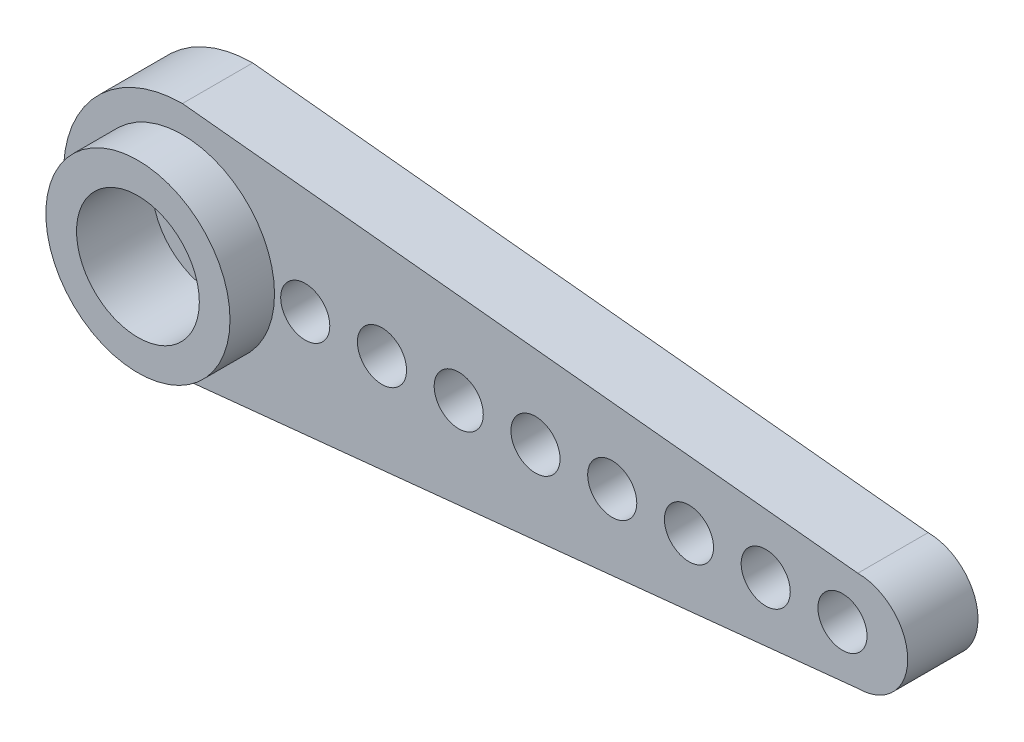
ISO-10303-21;
HEADER;
FILE_DESCRIPTION(('STEP AP214'),'2;1');
FILE_NAME('part.step','',(''),(''),'','','');
FILE_SCHEMA(('AUTOMOTIVE_DESIGN { 1 0 10303 214 1 1 1 1 }'));
ENDSEC;
DATA;
#1=APPLICATION_CONTEXT('core data for automotive mechanical design processes');
#2=APPLICATION_PROTOCOL_DEFINITION('international standard','automotive_design',2000,#1);
#3=PRODUCT_CONTEXT('',#1,'mechanical');
#4=PRODUCT('Part','Part','',(#3));
#5=PRODUCT_RELATED_PRODUCT_CATEGORY('part','',(#4));
#6=PRODUCT_DEFINITION_FORMATION('','',#4);
#7=PRODUCT_DEFINITION_CONTEXT('part definition',#1,'design');
#8=PRODUCT_DEFINITION('design','',#6,#7);
#9=PRODUCT_DEFINITION_SHAPE('','',#8);
#10=(LENGTH_UNIT() NAMED_UNIT(*) SI_UNIT(.MILLI.,.METRE.));
#11=(NAMED_UNIT(*) PLANE_ANGLE_UNIT() SI_UNIT($,.RADIAN.));
#12=(NAMED_UNIT(*) SI_UNIT($,.STERADIAN.) SOLID_ANGLE_UNIT());
#13=UNCERTAINTY_MEASURE_WITH_UNIT(LENGTH_MEASURE(1.E-05),#10,'distance_accuracy_value','');
#14=(GEOMETRIC_REPRESENTATION_CONTEXT(3) GLOBAL_UNCERTAINTY_ASSIGNED_CONTEXT((#13)) GLOBAL_UNIT_ASSIGNED_CONTEXT((#10,
#11,#12)) REPRESENTATION_CONTEXT('',''));
#15=CARTESIAN_POINT('',(0.,0.,0.));
#16=DIRECTION('',(0.,0.,1.));
#17=DIRECTION('',(1.,0.,0.));
#18=AXIS2_PLACEMENT_3D('',#15,#16,#17);
#19=CARTESIAN_POINT('',(38.,0.,7.48));
#20=DIRECTION('',(0.,0.,-1.));
#21=DIRECTION('',(-1.,0.,0.));
#22=AXIS2_PLACEMENT_3D('',#19,#20,#21);
#23=CYLINDRICAL_SURFACE('',#22,1.6);
#24=CARTESIAN_POINT('',(38.,0.,4.58));
#25=DIRECTION('',(0.,0.,1.));
#26=DIRECTION('',(1.,0.,0.));
#27=AXIS2_PLACEMENT_3D('',#24,#25,#26);
#28=CIRCLE('',#27,1.6);
#29=CARTESIAN_POINT('',(39.6,0.,4.58));
#30=VERTEX_POINT('',#29);
#31=EDGE_CURVE('E47',#30,#30,#28,.T.);
#32=ORIENTED_EDGE('',*,*,#31,.T.);
#33=EDGE_LOOP('',(#32));
#34=FACE_BOUND('',#33,.T.);
#35=CARTESIAN_POINT('',(38.,0.,0.));
#36=DIRECTION('',(0.,0.,-1.));
#37=DIRECTION('',(-1.,0.,0.));
#38=AXIS2_PLACEMENT_3D('',#35,#36,#37);
#39=CIRCLE('',#38,1.6);
#40=CARTESIAN_POINT('',(36.4,0.,0.));
#41=VERTEX_POINT('',#40);
#42=EDGE_CURVE('E11',#41,#41,#39,.T.);
#43=ORIENTED_EDGE('',*,*,#42,.T.);
#44=EDGE_LOOP('',(#43));
#45=FACE_BOUND('',#44,.T.);
#46=ADVANCED_FACE('F39',(#34,#45),#23,.F.);
#47=CARTESIAN_POINT('',(33.,0.,7.48));
#48=DIRECTION('',(0.,0.,-1.));
#49=DIRECTION('',(-1.,0.,0.));
#50=AXIS2_PLACEMENT_3D('',#47,#48,#49);
#51=CYLINDRICAL_SURFACE('',#50,1.6);
#52=CARTESIAN_POINT('',(33.,0.,4.58));
#53=DIRECTION('',(0.,0.,1.));
#54=DIRECTION('',(1.,0.,0.));
#55=AXIS2_PLACEMENT_3D('',#52,#53,#54);
#56=CIRCLE('',#55,1.6);
#57=CARTESIAN_POINT('',(34.6,0.,4.58));
#58=VERTEX_POINT('',#57);
#59=EDGE_CURVE('E146',#58,#58,#56,.T.);
#60=ORIENTED_EDGE('',*,*,#59,.T.);
#61=EDGE_LOOP('',(#60));
#62=FACE_BOUND('',#61,.T.);
#63=CARTESIAN_POINT('',(33.,0.,0.));
#64=DIRECTION('',(0.,0.,-1.));
#65=DIRECTION('',(-1.,0.,0.));
#66=AXIS2_PLACEMENT_3D('',#63,#64,#65);
#67=CIRCLE('',#66,1.6);
#68=CARTESIAN_POINT('',(31.4,0.,0.));
#69=VERTEX_POINT('',#68);
#70=EDGE_CURVE('E149',#69,#69,#67,.T.);
#71=ORIENTED_EDGE('',*,*,#70,.T.);
#72=EDGE_LOOP('',(#71));
#73=FACE_BOUND('',#72,.T.);
#74=ADVANCED_FACE('F173',(#62,#73),#51,.F.);
#75=CARTESIAN_POINT('',(28.,0.,7.48));
#76=DIRECTION('',(0.,0.,-1.));
#77=DIRECTION('',(-1.,0.,0.));
#78=AXIS2_PLACEMENT_3D('',#75,#76,#77);
#79=CYLINDRICAL_SURFACE('',#78,1.6);
#80=CARTESIAN_POINT('',(28.,0.,4.58));
#81=DIRECTION('',(0.,0.,1.));
#82=DIRECTION('',(1.,0.,0.));
#83=AXIS2_PLACEMENT_3D('',#80,#81,#82);
#84=CIRCLE('',#83,1.6);
#85=CARTESIAN_POINT('',(29.6,0.,4.58));
#86=VERTEX_POINT('',#85);
#87=EDGE_CURVE('E140',#86,#86,#84,.T.);
#88=ORIENTED_EDGE('',*,*,#87,.T.);
#89=EDGE_LOOP('',(#88));
#90=FACE_BOUND('',#89,.T.);
#91=CARTESIAN_POINT('',(28.,0.,0.));
#92=DIRECTION('',(0.,0.,-1.));
#93=DIRECTION('',(-1.,0.,0.));
#94=AXIS2_PLACEMENT_3D('',#91,#92,#93);
#95=CIRCLE('',#94,1.6);
#96=CARTESIAN_POINT('',(26.4,0.,0.));
#97=VERTEX_POINT('',#96);
#98=EDGE_CURVE('E143',#97,#97,#95,.T.);
#99=ORIENTED_EDGE('',*,*,#98,.T.);
#100=EDGE_LOOP('',(#99));
#101=FACE_BOUND('',#100,.T.);
#102=ADVANCED_FACE('F177',(#90,#101),#79,.F.);
#103=CARTESIAN_POINT('',(23.,0.,7.48));
#104=DIRECTION('',(0.,0.,-1.));
#105=DIRECTION('',(-1.,0.,0.));
#106=AXIS2_PLACEMENT_3D('',#103,#104,#105);
#107=CYLINDRICAL_SURFACE('',#106,1.6);
#108=CARTESIAN_POINT('',(23.,0.,4.58));
#109=DIRECTION('',(0.,0.,1.));
#110=DIRECTION('',(1.,0.,0.));
#111=AXIS2_PLACEMENT_3D('',#108,#109,#110);
#112=CIRCLE('',#111,1.6);
#113=CARTESIAN_POINT('',(24.6,0.,4.58));
#114=VERTEX_POINT('',#113);
#115=EDGE_CURVE('E134',#114,#114,#112,.T.);
#116=ORIENTED_EDGE('',*,*,#115,.T.);
#117=EDGE_LOOP('',(#116));
#118=FACE_BOUND('',#117,.T.);
#119=CARTESIAN_POINT('',(23.,0.,0.));
#120=DIRECTION('',(0.,0.,-1.));
#121=DIRECTION('',(-1.,0.,0.));
#122=AXIS2_PLACEMENT_3D('',#119,#120,#121);
#123=CIRCLE('',#122,1.6);
#124=CARTESIAN_POINT('',(21.4,0.,0.));
#125=VERTEX_POINT('',#124);
#126=EDGE_CURVE('E137',#125,#125,#123,.T.);
#127=ORIENTED_EDGE('',*,*,#126,.T.);
#128=EDGE_LOOP('',(#127));
#129=FACE_BOUND('',#128,.T.);
#130=ADVANCED_FACE('F182',(#118,#129),#107,.F.);
#131=CARTESIAN_POINT('',(18.,0.,7.48));
#132=DIRECTION('',(0.,0.,-1.));
#133=DIRECTION('',(-1.,0.,0.));
#134=AXIS2_PLACEMENT_3D('',#131,#132,#133);
#135=CYLINDRICAL_SURFACE('',#134,1.6);
#136=CARTESIAN_POINT('',(18.,0.,4.58));
#137=DIRECTION('',(0.,0.,1.));
#138=DIRECTION('',(1.,0.,0.));
#139=AXIS2_PLACEMENT_3D('',#136,#137,#138);
#140=CIRCLE('',#139,1.6);
#141=CARTESIAN_POINT('',(19.6,0.,4.58));
#142=VERTEX_POINT('',#141);
#143=EDGE_CURVE('E123',#142,#142,#140,.T.);
#144=ORIENTED_EDGE('',*,*,#143,.T.);
#145=EDGE_LOOP('',(#144));
#146=FACE_BOUND('',#145,.T.);
#147=CARTESIAN_POINT('',(18.,0.,0.));
#148=DIRECTION('',(0.,0.,-1.));
#149=DIRECTION('',(-1.,0.,0.));
#150=AXIS2_PLACEMENT_3D('',#147,#148,#149);
#151=CIRCLE('',#150,1.6);
#152=CARTESIAN_POINT('',(16.4,0.,0.));
#153=VERTEX_POINT('',#152);
#154=EDGE_CURVE('E131',#153,#153,#151,.T.);
#155=ORIENTED_EDGE('',*,*,#154,.T.);
#156=EDGE_LOOP('',(#155));
#157=FACE_BOUND('',#156,.T.);
#158=ADVANCED_FACE('F189',(#146,#157),#135,.F.);
#159=CARTESIAN_POINT('',(0.,0.,4.58));
#160=DIRECTION('',(0.,0.,-1.));
#161=DIRECTION('',(-1.,0.,0.));
#162=AXIS2_PLACEMENT_3D('',#159,#160,#161);
#163=CYLINDRICAL_SURFACE('',#162,7.75);
#164=CARTESIAN_POINT('',(0.,0.,0.));
#165=DIRECTION('',(0.,0.,1.));
#166=DIRECTION('',(1.,0.,0.));
#167=AXIS2_PLACEMENT_3D('',#164,#165,#166);
#168=CIRCLE('',#167,7.75);
#169=CARTESIAN_POINT('',(0.,7.75,0.));
#170=VERTEX_POINT('',#169);
#171=CARTESIAN_POINT('',(0.,-7.75,0.));
#172=VERTEX_POINT('',#171);
#173=EDGE_CURVE('E107',#170,#172,#168,.T.);
#174=ORIENTED_EDGE('',*,*,#173,.T.);
#175=DIRECTION('',(0.,0.,-1.));
#176=VECTOR('',#175,1.);
#177=CARTESIAN_POINT('',(0.,-7.75,4.58));
#178=LINE('',#177,#176);
#179=CARTESIAN_POINT('',(0.,-7.75,4.58));
#180=VERTEX_POINT('',#179);
#181=EDGE_CURVE('E99',#180,#172,#178,.T.);
#182=ORIENTED_EDGE('',*,*,#181,.F.);
#183=CARTESIAN_POINT('',(0.,0.,4.58));
#184=DIRECTION('',(0.,0.,1.));
#185=DIRECTION('',(1.,0.,0.));
#186=AXIS2_PLACEMENT_3D('',#183,#184,#185);
#187=CIRCLE('',#186,7.75);
#188=CARTESIAN_POINT('',(0.,7.75,4.58));
#189=VERTEX_POINT('',#188);
#190=EDGE_CURVE('E90',#189,#180,#187,.T.);
#191=ORIENTED_EDGE('',*,*,#190,.F.);
#192=DIRECTION('',(0.,0.,-1.));
#193=VECTOR('',#192,1.);
#194=CARTESIAN_POINT('',(0.,7.75,4.58));
#195=LINE('',#194,#193);
#196=EDGE_CURVE('E55',#189,#170,#195,.T.);
#197=ORIENTED_EDGE('',*,*,#196,.T.);
#198=EDGE_LOOP('',(#174,#182,#191,#197));
#199=FACE_BOUND('',#198,.T.);
#200=ADVANCED_FACE('F193',(#199),#163,.T.);
#201=CARTESIAN_POINT('',(0.784408945686901,-7.66977635782747,4.58));
#202=DIRECTION('',(-0.10174201540996,0.99481081734183,0.));
#203=DIRECTION('',(-0.99481081734183,-0.10174201540996,0.));
#204=AXIS2_PLACEMENT_3D('',#201,#202,#203);
#205=PLANE('',#204);
#206=DIRECTION('',(0.99481081734183,0.10174201540996,0.));
#207=VECTOR('',#206,1.);
#208=CARTESIAN_POINT('',(0.784408945686901,-7.66977635782747,0.));
#209=LINE('',#208,#207);
#210=CARTESIAN_POINT('',(44.,-3.25,0.));
#211=VERTEX_POINT('',#210);
#212=EDGE_CURVE('E96',#172,#211,#209,.T.);
#213=ORIENTED_EDGE('',*,*,#212,.T.);
#214=DIRECTION('',(0.,0.,-1.));
#215=VECTOR('',#214,1.);
#216=CARTESIAN_POINT('',(44.,-3.25,4.58));
#217=LINE('',#216,#215);
#218=CARTESIAN_POINT('',(44.,-3.25,4.58));
#219=VERTEX_POINT('',#218);
#220=EDGE_CURVE('E94',#219,#211,#217,.T.);
#221=ORIENTED_EDGE('',*,*,#220,.F.);
#222=DIRECTION('',(0.99481081734183,0.10174201540996,0.));
#223=VECTOR('',#222,1.);
#224=CARTESIAN_POINT('',(0.784408945686901,-7.66977635782747,4.58));
#225=LINE('',#224,#223);
#226=EDGE_CURVE('E82',#180,#219,#225,.T.);
#227=ORIENTED_EDGE('',*,*,#226,.F.);
#228=ORIENTED_EDGE('',*,*,#181,.T.);
#229=EDGE_LOOP('',(#213,#221,#227,#228));
#230=FACE_BOUND('',#229,.T.);
#231=ADVANCED_FACE('F95',(#230),#205,.F.);
#232=CARTESIAN_POINT('',(44.,0.,4.58));
#233=DIRECTION('',(0.,0.,-1.));
#234=DIRECTION('',(-1.,0.,0.));
#235=AXIS2_PLACEMENT_3D('',#232,#233,#234);
#236=CYLINDRICAL_SURFACE('',#235,3.25);
#237=CARTESIAN_POINT('',(44.,0.,0.));
#238=DIRECTION('',(0.,0.,1.));
#239=DIRECTION('',(1.,0.,0.));
#240=AXIS2_PLACEMENT_3D('',#237,#238,#239);
#241=CIRCLE('',#240,3.25);
#242=CARTESIAN_POINT('',(44.,3.25,0.));
#243=VERTEX_POINT('',#242);
#244=EDGE_CURVE('E111',#211,#243,#241,.T.);
#245=ORIENTED_EDGE('',*,*,#244,.T.);
#246=DIRECTION('',(0.,0.,-1.));
#247=VECTOR('',#246,1.);
#248=CARTESIAN_POINT('',(44.,3.25,4.58));
#249=LINE('',#248,#247);
#250=CARTESIAN_POINT('',(44.,3.25,4.58));
#251=VERTEX_POINT('',#250);
#252=EDGE_CURVE('E70',#251,#243,#249,.T.);
#253=ORIENTED_EDGE('',*,*,#252,.F.);
#254=CARTESIAN_POINT('',(44.,0.,4.58));
#255=DIRECTION('',(0.,0.,1.));
#256=DIRECTION('',(1.,0.,0.));
#257=AXIS2_PLACEMENT_3D('',#254,#255,#256);
#258=CIRCLE('',#257,3.25);
#259=EDGE_CURVE('E89',#219,#251,#258,.T.);
#260=ORIENTED_EDGE('',*,*,#259,.F.);
#261=ORIENTED_EDGE('',*,*,#220,.T.);
#262=EDGE_LOOP('',(#245,#253,#260,#261));
#263=FACE_BOUND('',#262,.T.);
#264=ADVANCED_FACE('F101',(#263),#236,.T.);
#265=CARTESIAN_POINT('',(0.784408945686901,7.66977635782747,4.58));
#266=DIRECTION('',(0.10174201540996,0.99481081734183,0.));
#267=DIRECTION('',(-0.99481081734183,0.10174201540996,0.));
#268=AXIS2_PLACEMENT_3D('',#265,#266,#267);
#269=PLANE('',#268);
#270=DIRECTION('',(0.99481081734183,-0.10174201540996,0.));
#271=VECTOR('',#270,1.);
#272=CARTESIAN_POINT('',(0.784408945686901,7.66977635782747,0.));
#273=LINE('',#272,#271);
#274=EDGE_CURVE('E113',#170,#243,#273,.T.);
#275=ORIENTED_EDGE('',*,*,#274,.F.);
#276=ORIENTED_EDGE('',*,*,#196,.F.);
#277=DIRECTION('',(0.99481081734183,-0.10174201540996,0.));
#278=VECTOR('',#277,1.);
#279=CARTESIAN_POINT('',(0.784408945686901,7.66977635782747,4.58));
#280=LINE('',#279,#278);
#281=EDGE_CURVE('E102',#189,#251,#280,.T.);
#282=ORIENTED_EDGE('',*,*,#281,.T.);
#283=ORIENTED_EDGE('',*,*,#252,.T.);
#284=EDGE_LOOP('',(#275,#276,#282,#283));
#285=FACE_BOUND('',#284,.T.);
#286=ADVANCED_FACE('F158',(#285),#269,.T.);
#287=CARTESIAN_POINT('',(0.,0.,4.58));
#288=DIRECTION('',(0.,0.,1.));
#289=DIRECTION('',(1.,0.,0.));
#290=AXIS2_PLACEMENT_3D('',#287,#288,#289);
#291=PLANE('',#290);
#292=CARTESIAN_POINT('',(43.,0.,4.58));
#293=DIRECTION('',(0.,0.,1.));
#294=DIRECTION('',(1.,0.,0.));
#295=AXIS2_PLACEMENT_3D('',#292,#293,#294);
#296=CIRCLE('',#295,1.6);
#297=CARTESIAN_POINT('',(44.6,0.,4.58));
#298=VERTEX_POINT('',#297);
#299=EDGE_CURVE('E370',#298,#298,#296,.T.);
#300=ORIENTED_EDGE('',*,*,#299,.F.);
#301=EDGE_LOOP('',(#300));
#302=FACE_BOUND('',#301,.T.);
#303=CARTESIAN_POINT('',(13.,0.,4.58));
#304=DIRECTION('',(0.,0.,1.));
#305=DIRECTION('',(1.,0.,0.));
#306=AXIS2_PLACEMENT_3D('',#303,#304,#305);
#307=CIRCLE('',#306,1.6);
#308=CARTESIAN_POINT('',(14.6,0.,4.58));
#309=VERTEX_POINT('',#308);
#310=EDGE_CURVE('E375',#309,#309,#307,.T.);
#311=ORIENTED_EDGE('',*,*,#310,.F.);
#312=EDGE_LOOP('',(#311));
#313=FACE_BOUND('',#312,.T.);
#314=CARTESIAN_POINT('',(8.,0.,4.58));
#315=DIRECTION('',(0.,0.,1.));
#316=DIRECTION('',(1.,0.,0.));
#317=AXIS2_PLACEMENT_3D('',#314,#315,#316);
#318=CIRCLE('',#317,1.6);
#319=CARTESIAN_POINT('',(9.6,0.,4.58));
#320=VERTEX_POINT('',#319);
#321=EDGE_CURVE('E386',#320,#320,#318,.T.);
#322=ORIENTED_EDGE('',*,*,#321,.F.);
#323=EDGE_LOOP('',(#322));
#324=FACE_BOUND('',#323,.T.);
#325=CARTESIAN_POINT('',(0.,0.,4.58));
#326=DIRECTION('',(0.,0.,1.));
#327=DIRECTION('',(1.,0.,0.));
#328=AXIS2_PLACEMENT_3D('',#325,#326,#327);
#329=CIRCLE('',#328,6.);
#330=CARTESIAN_POINT('',(6.,0.,4.58));
#331=VERTEX_POINT('',#330);
#332=EDGE_CURVE('E119',#331,#331,#329,.T.);
#333=ORIENTED_EDGE('',*,*,#332,.F.);
#334=EDGE_LOOP('',(#333));
#335=FACE_BOUND('',#334,.T.);
#336=ORIENTED_EDGE('',*,*,#190,.T.);
#337=ORIENTED_EDGE('',*,*,#226,.T.);
#338=ORIENTED_EDGE('',*,*,#259,.T.);
#339=ORIENTED_EDGE('',*,*,#281,.F.);
#340=EDGE_LOOP('',(#336,#337,#338,#339));
#341=FACE_BOUND('',#340,.T.);
#342=ORIENTED_EDGE('',*,*,#143,.F.);
#343=EDGE_LOOP('',(#342));
#344=FACE_BOUND('',#343,.T.);
#345=ORIENTED_EDGE('',*,*,#115,.F.);
#346=EDGE_LOOP('',(#345));
#347=FACE_BOUND('',#346,.T.);
#348=ORIENTED_EDGE('',*,*,#87,.F.);
#349=EDGE_LOOP('',(#348));
#350=FACE_BOUND('',#349,.T.);
#351=ORIENTED_EDGE('',*,*,#59,.F.);
#352=EDGE_LOOP('',(#351));
#353=FACE_BOUND('',#352,.T.);
#354=ORIENTED_EDGE('',*,*,#31,.F.);
#355=EDGE_LOOP('',(#354));
#356=FACE_BOUND('',#355,.T.);
#357=ADVANCED_FACE('F85',(#302,#313,#324,#335,#341,#344,#347,#350,#353,#356),#291,.T.);
#358=CARTESIAN_POINT('',(0.,0.,0.));
#359=DIRECTION('',(0.,0.,1.));
#360=DIRECTION('',(1.,0.,0.));
#361=AXIS2_PLACEMENT_3D('',#358,#359,#360);
#362=PLANE('',#361);
#363=CARTESIAN_POINT('',(43.,0.,0.));
#364=DIRECTION('',(0.,0.,-1.));
#365=DIRECTION('',(-1.,0.,0.));
#366=AXIS2_PLACEMENT_3D('',#363,#364,#365);
#367=CIRCLE('',#366,1.6);
#368=CARTESIAN_POINT('',(41.4,0.,0.));
#369=VERTEX_POINT('',#368);
#370=EDGE_CURVE('E373',#369,#369,#367,.T.);
#371=ORIENTED_EDGE('',*,*,#370,.F.);
#372=EDGE_LOOP('',(#371));
#373=FACE_BOUND('',#372,.T.);
#374=CARTESIAN_POINT('',(13.,0.,0.));
#375=DIRECTION('',(0.,0.,-1.));
#376=DIRECTION('',(-1.,0.,0.));
#377=AXIS2_PLACEMENT_3D('',#374,#375,#376);
#378=CIRCLE('',#377,1.6);
#379=CARTESIAN_POINT('',(11.4,0.,0.));
#380=VERTEX_POINT('',#379);
#381=EDGE_CURVE('E380',#380,#380,#378,.T.);
#382=ORIENTED_EDGE('',*,*,#381,.F.);
#383=EDGE_LOOP('',(#382));
#384=FACE_BOUND('',#383,.T.);
#385=CARTESIAN_POINT('',(8.,0.,0.));
#386=DIRECTION('',(0.,0.,-1.));
#387=DIRECTION('',(-1.,0.,0.));
#388=AXIS2_PLACEMENT_3D('',#385,#386,#387);
#389=CIRCLE('',#388,1.6);
#390=CARTESIAN_POINT('',(6.4,0.,0.));
#391=VERTEX_POINT('',#390);
#392=EDGE_CURVE('E383',#391,#391,#389,.T.);
#393=ORIENTED_EDGE('',*,*,#392,.F.);
#394=EDGE_LOOP('',(#393));
#395=FACE_BOUND('',#394,.T.);
#396=CARTESIAN_POINT('',(0.,0.,0.));
#397=DIRECTION('',(0.,0.,1.));
#398=DIRECTION('',(1.,0.,0.));
#399=AXIS2_PLACEMENT_3D('',#396,#397,#398);
#400=CIRCLE('',#399,4.65);
#401=CARTESIAN_POINT('',(4.65,0.,0.));
#402=VERTEX_POINT('',#401);
#403=EDGE_CURVE('E120',#402,#402,#400,.F.);
#404=ORIENTED_EDGE('',*,*,#403,.F.);
#405=EDGE_LOOP('',(#404));
#406=FACE_BOUND('',#405,.T.);
#407=ORIENTED_EDGE('',*,*,#173,.F.);
#408=ORIENTED_EDGE('',*,*,#274,.T.);
#409=ORIENTED_EDGE('',*,*,#244,.F.);
#410=ORIENTED_EDGE('',*,*,#212,.F.);
#411=EDGE_LOOP('',(#407,#408,#409,#410));
#412=FACE_BOUND('',#411,.T.);
#413=ORIENTED_EDGE('',*,*,#154,.F.);
#414=EDGE_LOOP('',(#413));
#415=FACE_BOUND('',#414,.T.);
#416=ORIENTED_EDGE('',*,*,#126,.F.);
#417=EDGE_LOOP('',(#416));
#418=FACE_BOUND('',#417,.T.);
#419=ORIENTED_EDGE('',*,*,#98,.F.);
#420=EDGE_LOOP('',(#419));
#421=FACE_BOUND('',#420,.T.);
#422=ORIENTED_EDGE('',*,*,#70,.F.);
#423=EDGE_LOOP('',(#422));
#424=FACE_BOUND('',#423,.T.);
#425=ORIENTED_EDGE('',*,*,#42,.F.);
#426=EDGE_LOOP('',(#425));
#427=FACE_BOUND('',#426,.T.);
#428=ADVANCED_FACE('F157',(#373,#384,#395,#406,#412,#415,#418,#421,#424,#427),#362,.F.);
#429=CARTESIAN_POINT('',(0.,0.,7.48));
#430=DIRECTION('',(0.,0.,-1.));
#431=DIRECTION('',(-1.,0.,0.));
#432=AXIS2_PLACEMENT_3D('',#429,#430,#431);
#433=CYLINDRICAL_SURFACE('',#432,6.);
#434=CARTESIAN_POINT('',(0.,0.,7.48));
#435=DIRECTION('',(0.,0.,1.));
#436=DIRECTION('',(1.,0.,0.));
#437=AXIS2_PLACEMENT_3D('',#434,#435,#436);
#438=CIRCLE('',#437,6.);
#439=CARTESIAN_POINT('',(6.,0.,7.48));
#440=VERTEX_POINT('',#439);
#441=EDGE_CURVE('E109',#440,#440,#438,.T.);
#442=ORIENTED_EDGE('',*,*,#441,.F.);
#443=EDGE_LOOP('',(#442));
#444=FACE_BOUND('',#443,.T.);
#445=ORIENTED_EDGE('',*,*,#332,.T.);
#446=EDGE_LOOP('',(#445));
#447=FACE_BOUND('',#446,.T.);
#448=ADVANCED_FACE('F165',(#444,#447),#433,.T.);
#449=CARTESIAN_POINT('',(0.,0.,7.48));
#450=DIRECTION('',(0.,0.,1.));
#451=DIRECTION('',(1.,0.,0.));
#452=AXIS2_PLACEMENT_3D('',#449,#450,#451);
#453=PLANE('',#452);
#454=CARTESIAN_POINT('',(0.,0.,7.48));
#455=DIRECTION('',(0.,0.,1.));
#456=DIRECTION('',(1.,0.,0.));
#457=AXIS2_PLACEMENT_3D('',#454,#455,#456);
#458=CIRCLE('',#457,4.);
#459=CARTESIAN_POINT('',(4.,0.,7.48));
#460=VERTEX_POINT('',#459);
#461=EDGE_CURVE('E399',#460,#460,#458,.T.);
#462=ORIENTED_EDGE('',*,*,#461,.F.);
#463=EDGE_LOOP('',(#462));
#464=FACE_BOUND('',#463,.T.);
#465=ORIENTED_EDGE('',*,*,#441,.T.);
#466=EDGE_LOOP('',(#465));
#467=FACE_BOUND('',#466,.T.);
#468=ADVANCED_FACE('F218',(#464,#467),#453,.T.);
#469=CARTESIAN_POINT('',(0.,0.,2.545));
#470=DIRECTION('',(0.,0.,1.));
#471=DIRECTION('',(1.,0.,0.));
#472=AXIS2_PLACEMENT_3D('',#469,#470,#471);
#473=CYLINDRICAL_SURFACE('',#472,4.);
#474=CARTESIAN_POINT('',(0.,0.,2.545));
#475=DIRECTION('',(0.,0.,1.));
#476=DIRECTION('',(1.,0.,0.));
#477=AXIS2_PLACEMENT_3D('',#474,#475,#476);
#478=CIRCLE('',#477,4.);
#479=CARTESIAN_POINT('',(4.,0.,2.545));
#480=VERTEX_POINT('',#479);
#481=EDGE_CURVE('E400',#480,#480,#478,.T.);
#482=ORIENTED_EDGE('',*,*,#481,.F.);
#483=EDGE_LOOP('',(#482));
#484=FACE_BOUND('',#483,.T.);
#485=ORIENTED_EDGE('',*,*,#461,.T.);
#486=EDGE_LOOP('',(#485));
#487=FACE_BOUND('',#486,.T.);
#488=ADVANCED_FACE('F228',(#484,#487),#473,.F.);
#489=CARTESIAN_POINT('',(0.,0.,2.545));
#490=DIRECTION('',(0.,0.,1.));
#491=DIRECTION('',(1.,0.,0.));
#492=AXIS2_PLACEMENT_3D('',#489,#490,#491);
#493=PLANE('',#492);
#494=CARTESIAN_POINT('',(0.,0.,2.545));
#495=DIRECTION('',(0.,0.,1.));
#496=DIRECTION('',(1.,0.,0.));
#497=AXIS2_PLACEMENT_3D('',#494,#495,#496);
#498=CIRCLE('',#497,1.575);
#499=CARTESIAN_POINT('',(1.575,0.,2.545));
#500=VERTEX_POINT('',#499);
#501=EDGE_CURVE('E128',#500,#500,#498,.T.);
#502=ORIENTED_EDGE('',*,*,#501,.F.);
#503=EDGE_LOOP('',(#502));
#504=FACE_BOUND('',#503,.T.);
#505=ORIENTED_EDGE('',*,*,#481,.T.);
#506=EDGE_LOOP('',(#505));
#507=FACE_BOUND('',#506,.T.);
#508=ADVANCED_FACE('F238',(#504,#507),#493,.T.);
#509=CARTESIAN_POINT('',(0.,0.,-0.4));
#510=DIRECTION('',(0.,0.,1.));
#511=DIRECTION('',(1.,0.,0.));
#512=AXIS2_PLACEMENT_3D('',#509,#510,#511);
#513=CYLINDRICAL_SURFACE('',#512,4.65);
#514=CARTESIAN_POINT('',(0.,0.,-0.4));
#515=DIRECTION('',(0.,0.,-1.));
#516=DIRECTION('',(-1.,0.,0.));
#517=AXIS2_PLACEMENT_3D('',#514,#515,#516);
#518=CIRCLE('',#517,4.65);
#519=CARTESIAN_POINT('',(-4.65,0.,-0.4));
#520=VERTEX_POINT('',#519);
#521=EDGE_CURVE('E394',#520,#520,#518,.T.);
#522=ORIENTED_EDGE('',*,*,#521,.F.);
#523=EDGE_LOOP('',(#522));
#524=FACE_BOUND('',#523,.T.);
#525=ORIENTED_EDGE('',*,*,#403,.T.);
#526=EDGE_LOOP('',(#525));
#527=FACE_BOUND('',#526,.T.);
#528=ADVANCED_FACE('F246',(#524,#527),#513,.T.);
#529=CARTESIAN_POINT('',(0.,0.,-0.4));
#530=DIRECTION('',(0.,0.,-1.));
#531=DIRECTION('',(-1.,0.,0.));
#532=AXIS2_PLACEMENT_3D('',#529,#530,#531);
#533=PLANE('',#532);
#534=CARTESIAN_POINT('',(0.,0.,-0.4));
#535=DIRECTION('',(0.,0.,-1.));
#536=DIRECTION('',(-1.,0.,0.));
#537=AXIS2_PLACEMENT_3D('',#534,#535,#536);
#538=CIRCLE('',#537,3.8);
#539=CARTESIAN_POINT('',(-3.8,0.,-0.4));
#540=VERTEX_POINT('',#539);
#541=EDGE_CURVE('E127',#540,#540,#538,.T.);
#542=ORIENTED_EDGE('',*,*,#541,.F.);
#543=EDGE_LOOP('',(#542));
#544=FACE_BOUND('',#543,.T.);
#545=ORIENTED_EDGE('',*,*,#521,.T.);
#546=EDGE_LOOP('',(#545));
#547=FACE_BOUND('',#546,.T.);
#548=ADVANCED_FACE('F251',(#544,#547),#533,.T.);
#549=CARTESIAN_POINT('',(0.,0.,0.5));
#550=DIRECTION('',(0.,0.,-1.));
#551=DIRECTION('',(-1.,0.,0.));
#552=AXIS2_PLACEMENT_3D('',#549,#550,#551);
#553=CYLINDRICAL_SURFACE('',#552,3.8);
#554=CARTESIAN_POINT('',(0.,0.,0.5));
#555=DIRECTION('',(0.,0.,-1.));
#556=DIRECTION('',(-1.,0.,0.));
#557=AXIS2_PLACEMENT_3D('',#554,#555,#556);
#558=CIRCLE('',#557,3.8);
#559=CARTESIAN_POINT('',(-3.8,0.,0.5));
#560=VERTEX_POINT('',#559);
#561=EDGE_CURVE('E391',#560,#560,#558,.T.);
#562=ORIENTED_EDGE('',*,*,#561,.F.);
#563=EDGE_LOOP('',(#562));
#564=FACE_BOUND('',#563,.T.);
#565=ORIENTED_EDGE('',*,*,#541,.T.);
#566=EDGE_LOOP('',(#565));
#567=FACE_BOUND('',#566,.T.);
#568=ADVANCED_FACE('F261',(#564,#567),#553,.F.);
#569=CARTESIAN_POINT('',(0.,0.,0.5));
#570=DIRECTION('',(0.,0.,-1.));
#571=DIRECTION('',(-1.,0.,0.));
#572=AXIS2_PLACEMENT_3D('',#569,#570,#571);
#573=PLANE('',#572);
#574=CARTESIAN_POINT('',(0.,0.,0.5));
#575=DIRECTION('',(0.,0.,-1.));
#576=DIRECTION('',(-1.,0.,0.));
#577=AXIS2_PLACEMENT_3D('',#574,#575,#576);
#578=CIRCLE('',#577,1.575);
#579=CARTESIAN_POINT('',(-1.575,0.,0.5));
#580=VERTEX_POINT('',#579);
#581=EDGE_CURVE('E124',#580,#580,#578,.T.);
#582=ORIENTED_EDGE('',*,*,#581,.F.);
#583=EDGE_LOOP('',(#582));
#584=FACE_BOUND('',#583,.T.);
#585=ORIENTED_EDGE('',*,*,#561,.T.);
#586=EDGE_LOOP('',(#585));
#587=FACE_BOUND('',#586,.T.);
#588=ADVANCED_FACE('F271',(#584,#587),#573,.T.);
#589=CARTESIAN_POINT('',(0.,0.,-0.4));
#590=DIRECTION('',(0.,0.,1.));
#591=DIRECTION('',(1.,0.,0.));
#592=AXIS2_PLACEMENT_3D('',#589,#590,#591);
#593=CYLINDRICAL_SURFACE('',#592,1.575);
#594=ORIENTED_EDGE('',*,*,#581,.T.);
#595=EDGE_LOOP('',(#594));
#596=FACE_BOUND('',#595,.T.);
#597=ORIENTED_EDGE('',*,*,#501,.T.);
#598=EDGE_LOOP('',(#597));
#599=FACE_BOUND('',#598,.T.);
#600=ADVANCED_FACE('F288',(#596,#599),#593,.F.);
#601=CARTESIAN_POINT('',(8.,0.,7.48));
#602=DIRECTION('',(0.,0.,-1.));
#603=DIRECTION('',(-1.,0.,0.));
#604=AXIS2_PLACEMENT_3D('',#601,#602,#603);
#605=CYLINDRICAL_SURFACE('',#604,1.6);
#606=ORIENTED_EDGE('',*,*,#321,.T.);
#607=EDGE_LOOP('',(#606));
#608=FACE_BOUND('',#607,.T.);
#609=ORIENTED_EDGE('',*,*,#392,.T.);
#610=EDGE_LOOP('',(#609));
#611=FACE_BOUND('',#610,.T.);
#612=ADVANCED_FACE('F298',(#608,#611),#605,.F.);
#613=CARTESIAN_POINT('',(13.,0.,7.48));
#614=DIRECTION('',(0.,0.,-1.));
#615=DIRECTION('',(-1.,0.,0.));
#616=AXIS2_PLACEMENT_3D('',#613,#614,#615);
#617=CYLINDRICAL_SURFACE('',#616,1.6);
#618=ORIENTED_EDGE('',*,*,#310,.T.);
#619=EDGE_LOOP('',(#618));
#620=FACE_BOUND('',#619,.T.);
#621=ORIENTED_EDGE('',*,*,#381,.T.);
#622=EDGE_LOOP('',(#621));
#623=FACE_BOUND('',#622,.T.);
#624=ADVANCED_FACE('F307',(#620,#623),#617,.F.);
#625=CARTESIAN_POINT('',(43.,0.,7.48));
#626=DIRECTION('',(0.,0.,-1.));
#627=DIRECTION('',(-1.,0.,0.));
#628=AXIS2_PLACEMENT_3D('',#625,#626,#627);
#629=CYLINDRICAL_SURFACE('',#628,1.6);
#630=ORIENTED_EDGE('',*,*,#299,.T.);
#631=EDGE_LOOP('',(#630));
#632=FACE_BOUND('',#631,.T.);
#633=ORIENTED_EDGE('',*,*,#370,.T.);
#634=EDGE_LOOP('',(#633));
#635=FACE_BOUND('',#634,.T.);
#636=ADVANCED_FACE('F354',(#632,#635),#629,.F.);
#637=CLOSED_SHELL('',(#46,#74,#102,#130,#158,#200,#231,#264,#286,#357,#428,#448,#468,#488,#508,
#528,#548,#568,#588,#600,#612,#624,#636));
#638=MANIFOLD_SOLID_BREP('B2',#637);
#639=ADVANCED_BREP_SHAPE_REPRESENTATION('',(#18,#638),#14);
#640=SHAPE_DEFINITION_REPRESENTATION(#9,#639);
ENDSEC;
END-ISO-10303-21;
